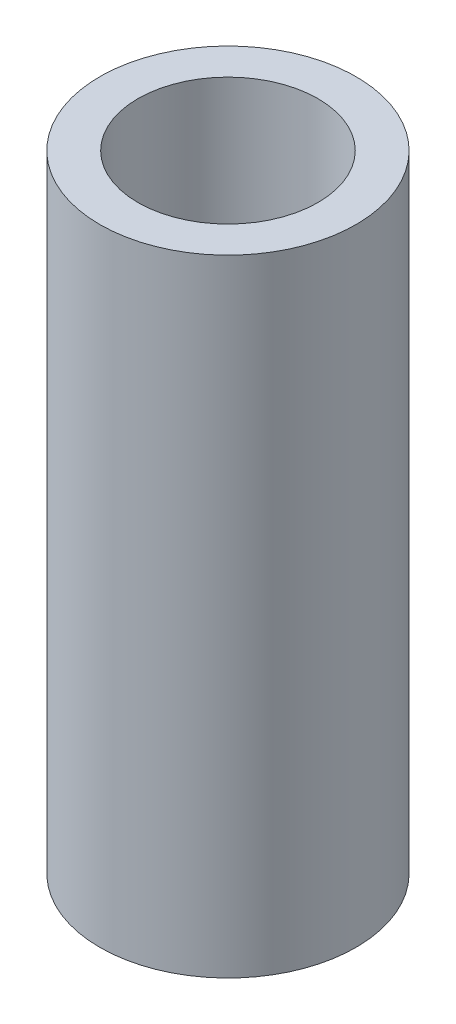
ISO-10303-21;
HEADER;
FILE_DESCRIPTION(('STEP AP214'),'2;1');
FILE_NAME('part.step','',(''),(''),'','','');
FILE_SCHEMA(('AUTOMOTIVE_DESIGN { 1 0 10303 214 1 1 1 1 }'));
ENDSEC;
DATA;
#1=APPLICATION_CONTEXT('core data for automotive mechanical design processes');
#2=APPLICATION_PROTOCOL_DEFINITION('international standard','automotive_design',2000,#1);
#3=PRODUCT_CONTEXT('',#1,'mechanical');
#4=PRODUCT('Part','Part','',(#3));
#5=PRODUCT_RELATED_PRODUCT_CATEGORY('part','',(#4));
#6=PRODUCT_DEFINITION_FORMATION('','',#4);
#7=PRODUCT_DEFINITION_CONTEXT('part definition',#1,'design');
#8=PRODUCT_DEFINITION('design','',#6,#7);
#9=PRODUCT_DEFINITION_SHAPE('','',#8);
#10=(LENGTH_UNIT() NAMED_UNIT(*) SI_UNIT(.MILLI.,.METRE.));
#11=(NAMED_UNIT(*) PLANE_ANGLE_UNIT() SI_UNIT($,.RADIAN.));
#12=(NAMED_UNIT(*) SI_UNIT($,.STERADIAN.) SOLID_ANGLE_UNIT());
#13=UNCERTAINTY_MEASURE_WITH_UNIT(LENGTH_MEASURE(1.E-05),#10,'distance_accuracy_value','');
#14=(GEOMETRIC_REPRESENTATION_CONTEXT(3) GLOBAL_UNCERTAINTY_ASSIGNED_CONTEXT((#13)) GLOBAL_UNIT_ASSIGNED_CONTEXT((#10,
#11,#12)) REPRESENTATION_CONTEXT('',''));
#15=CARTESIAN_POINT('',(0.,0.,0.));
#16=DIRECTION('',(0.,0.,1.));
#17=DIRECTION('',(1.,0.,0.));
#18=AXIS2_PLACEMENT_3D('',#15,#16,#17);
#19=CARTESIAN_POINT('',(0.,158.822481334805,0.));
#20=DIRECTION('',(0.,-1.,0.));
#21=DIRECTION('',(0.,0.,-1.));
#22=AXIS2_PLACEMENT_3D('',#19,#20,#21);
#23=CYLINDRICAL_SURFACE('',#22,32.5);
#24=CARTESIAN_POINT('',(0.,158.822481334805,0.));
#25=DIRECTION('',(0.,1.,0.));
#26=DIRECTION('',(0.,0.,1.));
#27=AXIS2_PLACEMENT_3D('',#24,#25,#26);
#28=CIRCLE('',#27,32.5);
#29=CARTESIAN_POINT('',(0.,158.822481334805,32.5));
#30=VERTEX_POINT('',#29);
#31=EDGE_CURVE('E10',#30,#30,#28,.T.);
#32=ORIENTED_EDGE('',*,*,#31,.F.);
#33=EDGE_LOOP('',(#32));
#34=FACE_BOUND('',#33,.T.);
#35=CARTESIAN_POINT('',(0.,0.,0.));
#36=DIRECTION('',(0.,1.,0.));
#37=DIRECTION('',(0.,0.,1.));
#38=AXIS2_PLACEMENT_3D('',#35,#36,#37);
#39=CIRCLE('',#38,32.5);
#40=CARTESIAN_POINT('',(0.,0.,32.5));
#41=VERTEX_POINT('',#40);
#42=EDGE_CURVE('E37',#41,#41,#39,.T.);
#43=ORIENTED_EDGE('',*,*,#42,.T.);
#44=EDGE_LOOP('',(#43));
#45=FACE_BOUND('',#44,.T.);
#46=ADVANCED_FACE('F40',(#34,#45),#23,.T.);
#47=CARTESIAN_POINT('',(0.,158.822481334805,0.));
#48=DIRECTION('',(0.,1.,0.));
#49=DIRECTION('',(0.,0.,1.));
#50=AXIS2_PLACEMENT_3D('',#47,#48,#49);
#51=PLANE('',#50);
#52=CARTESIAN_POINT('',(0.,158.822481334805,0.));
#53=DIRECTION('',(0.,1.,0.));
#54=DIRECTION('',(0.,0.,1.));
#55=AXIS2_PLACEMENT_3D('',#52,#53,#54);
#56=CIRCLE('',#55,22.8402607631503);
#57=CARTESIAN_POINT('',(0.,158.822481334805,22.8402607631503));
#58=VERTEX_POINT('',#57);
#59=EDGE_CURVE('E50',#58,#58,#56,.T.);
#60=ORIENTED_EDGE('',*,*,#59,.F.);
#61=EDGE_LOOP('',(#60));
#62=FACE_BOUND('',#61,.T.);
#63=ORIENTED_EDGE('',*,*,#31,.T.);
#64=EDGE_LOOP('',(#63));
#65=FACE_BOUND('',#64,.T.);
#66=ADVANCED_FACE('F59',(#62,#65),#51,.T.);
#67=CARTESIAN_POINT('',(0.,0.,0.));
#68=DIRECTION('',(0.,1.,0.));
#69=DIRECTION('',(0.,0.,1.));
#70=AXIS2_PLACEMENT_3D('',#67,#68,#69);
#71=PLANE('',#70);
#72=CARTESIAN_POINT('',(0.,0.,0.));
#73=DIRECTION('',(0.,1.,0.));
#74=DIRECTION('',(0.,0.,1.));
#75=AXIS2_PLACEMENT_3D('',#72,#73,#74);
#76=CIRCLE('',#75,22.8402607631503);
#77=CARTESIAN_POINT('',(0.,0.,22.8402607631503));
#78=VERTEX_POINT('',#77);
#79=EDGE_CURVE('E47',#78,#78,#76,.T.);
#80=ORIENTED_EDGE('',*,*,#79,.T.);
#81=EDGE_LOOP('',(#80));
#82=FACE_BOUND('',#81,.T.);
#83=ORIENTED_EDGE('',*,*,#42,.F.);
#84=EDGE_LOOP('',(#83));
#85=FACE_BOUND('',#84,.T.);
#86=ADVANCED_FACE('F58',(#82,#85),#71,.F.);
#87=CARTESIAN_POINT('',(0.,158.822481334805,0.));
#88=DIRECTION('',(0.,-1.,0.));
#89=DIRECTION('',(0.,0.,-1.));
#90=AXIS2_PLACEMENT_3D('',#87,#88,#89);
#91=CYLINDRICAL_SURFACE('',#90,22.8402607631503);
#92=ORIENTED_EDGE('',*,*,#59,.T.);
#93=EDGE_LOOP('',(#92));
#94=FACE_BOUND('',#93,.T.);
#95=ORIENTED_EDGE('',*,*,#79,.F.);
#96=EDGE_LOOP('',(#95));
#97=FACE_BOUND('',#96,.T.);
#98=ADVANCED_FACE('F54',(#94,#97),#91,.F.);
#99=CLOSED_SHELL('',(#46,#66,#86,#98));
#100=MANIFOLD_SOLID_BREP('B2',#99);
#101=ADVANCED_BREP_SHAPE_REPRESENTATION('',(#18,#100),#14);
#102=SHAPE_DEFINITION_REPRESENTATION(#9,#101);
ENDSEC;
END-ISO-10303-21;
